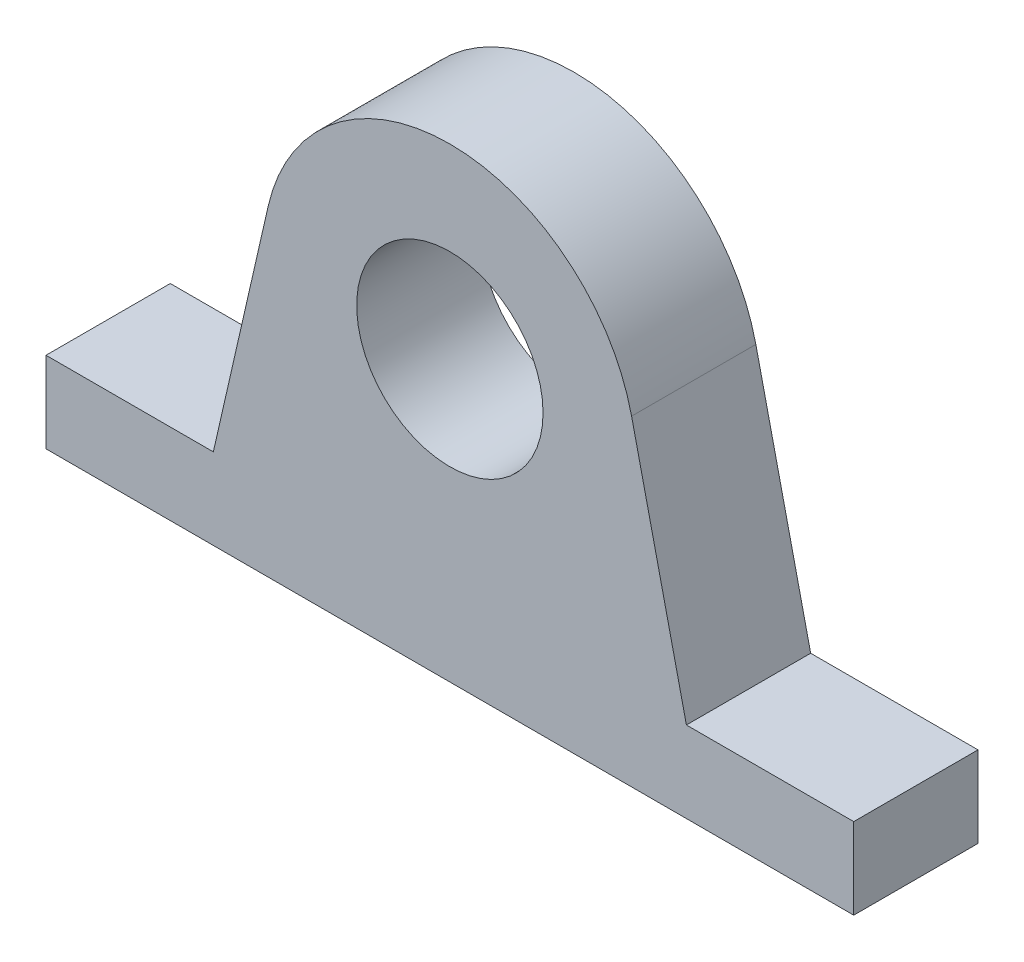
ISO-10303-21;
HEADER;
FILE_DESCRIPTION(('STEP AP214'),'2;1');
FILE_NAME('part.step','',(''),(''),'','','');
FILE_SCHEMA(('AUTOMOTIVE_DESIGN { 1 0 10303 214 1 1 1 1 }'));
ENDSEC;
DATA;
#1=APPLICATION_CONTEXT('core data for automotive mechanical design processes');
#2=APPLICATION_PROTOCOL_DEFINITION('international standard','automotive_design',2000,#1);
#3=PRODUCT_CONTEXT('',#1,'mechanical');
#4=PRODUCT('Part','Part','',(#3));
#5=PRODUCT_RELATED_PRODUCT_CATEGORY('part','',(#4));
#6=PRODUCT_DEFINITION_FORMATION('','',#4);
#7=PRODUCT_DEFINITION_CONTEXT('part definition',#1,'design');
#8=PRODUCT_DEFINITION('design','',#6,#7);
#9=PRODUCT_DEFINITION_SHAPE('','',#8);
#10=(LENGTH_UNIT() NAMED_UNIT(*) SI_UNIT(.MILLI.,.METRE.));
#11=(NAMED_UNIT(*) PLANE_ANGLE_UNIT() SI_UNIT($,.RADIAN.));
#12=(NAMED_UNIT(*) SI_UNIT($,.STERADIAN.) SOLID_ANGLE_UNIT());
#13=UNCERTAINTY_MEASURE_WITH_UNIT(LENGTH_MEASURE(1.E-05),#10,'distance_accuracy_value','');
#14=(GEOMETRIC_REPRESENTATION_CONTEXT(3) GLOBAL_UNCERTAINTY_ASSIGNED_CONTEXT((#13)) GLOBAL_UNIT_ASSIGNED_CONTEXT((#10,
#11,#12)) REPRESENTATION_CONTEXT('',''));
#15=CARTESIAN_POINT('',(0.,0.,0.));
#16=DIRECTION('',(0.,0.,1.));
#17=DIRECTION('',(1.,0.,0.));
#18=AXIS2_PLACEMENT_3D('',#15,#16,#17);
#19=CARTESIAN_POINT('',(0.,9.,4.));
#20=DIRECTION('',(0.,0.,1.));
#21=DIRECTION('',(1.,0.,0.));
#22=AXIS2_PLACEMENT_3D('',#19,#20,#21);
#23=PLANE('',#22);
#24=DIRECTION('',(-1.,0.,0.));
#25=VECTOR('',#24,1.);
#26=CARTESIAN_POINT('',(-13.,2.60921355768114,4.));
#27=LINE('',#26,#25);
#28=CARTESIAN_POINT('',(-7.61378638619367,2.60921355768114,4.));
#29=VERTEX_POINT('',#28);
#30=CARTESIAN_POINT('',(-13.,2.60921355768114,4.));
#31=VERTEX_POINT('',#30);
#32=EDGE_CURVE('E146',#29,#31,#27,.T.);
#33=ORIENTED_EDGE('',*,*,#32,.T.);
#34=DIRECTION('',(0.,-1.,0.));
#35=VECTOR('',#34,1.);
#36=CARTESIAN_POINT('',(-13.,0.,4.));
#37=LINE('',#36,#35);
#38=CARTESIAN_POINT('',(-13.,0.,4.));
#39=VERTEX_POINT('',#38);
#40=EDGE_CURVE('E93',#31,#39,#37,.T.);
#41=ORIENTED_EDGE('',*,*,#40,.T.);
#42=DIRECTION('',(1.,0.,0.));
#43=VECTOR('',#42,1.);
#44=CARTESIAN_POINT('',(-8.2096026206597,0.,4.));
#45=LINE('',#44,#43);
#46=CARTESIAN_POINT('',(13.,0.,4.));
#47=VERTEX_POINT('',#46);
#48=EDGE_CURVE('E160',#39,#47,#45,.T.);
#49=ORIENTED_EDGE('',*,*,#48,.T.);
#50=DIRECTION('',(0.,1.,0.));
#51=VECTOR('',#50,1.);
#52=CARTESIAN_POINT('',(13.,0.,4.));
#53=LINE('',#52,#51);
#54=CARTESIAN_POINT('',(13.,2.60921355768114,4.));
#55=VERTEX_POINT('',#54);
#56=EDGE_CURVE('E175',#47,#55,#53,.T.);
#57=ORIENTED_EDGE('',*,*,#56,.T.);
#58=DIRECTION('',(-1.,0.,0.));
#59=VECTOR('',#58,1.);
#60=CARTESIAN_POINT('',(13.,2.60921355768114,4.));
#61=LINE('',#60,#59);
#62=CARTESIAN_POINT('',(7.61378638619367,2.60921355768114,4.));
#63=VERTEX_POINT('',#62);
#64=EDGE_CURVE('E112',#55,#63,#61,.T.);
#65=ORIENTED_EDGE('',*,*,#64,.T.);
#66=DIRECTION('',(-0.222620466270927,0.974905189234992,0.));
#67=VECTOR('',#66,1.);
#68=CARTESIAN_POINT('',(7.61378638619367,2.60921355768114,4.));
#69=LINE('',#68,#67);
#70=CARTESIAN_POINT('',(5.84943113540995,10.3357227976256,4.));
#71=VERTEX_POINT('',#70);
#72=EDGE_CURVE('E106',#63,#71,#69,.T.);
#73=ORIENTED_EDGE('',*,*,#72,.T.);
#74=CARTESIAN_POINT('',(0.,9.,4.));
#75=DIRECTION('',(0.,0.,1.));
#76=DIRECTION('',(1.,0.,0.));
#77=AXIS2_PLACEMENT_3D('',#74,#75,#76);
#78=CIRCLE('',#77,6.);
#79=CARTESIAN_POINT('',(-5.84943113540995,10.3357227976256,4.));
#80=VERTEX_POINT('',#79);
#81=EDGE_CURVE('E110',#71,#80,#78,.T.);
#82=ORIENTED_EDGE('',*,*,#81,.T.);
#83=DIRECTION('',(-0.222620466270927,-0.974905189234992,0.));
#84=VECTOR('',#83,1.);
#85=CARTESIAN_POINT('',(-7.61378638619367,2.60921355768114,4.));
#86=LINE('',#85,#84);
#87=EDGE_CURVE('E50',#80,#29,#86,.T.);
#88=ORIENTED_EDGE('',*,*,#87,.T.);
#89=EDGE_LOOP('',(#33,#41,#49,#57,#65,#73,#82,#88));
#90=FACE_BOUND('',#89,.T.);
#91=CARTESIAN_POINT('',(0.,9.,4.));
#92=DIRECTION('',(0.,0.,1.));
#93=DIRECTION('',(1.,0.,0.));
#94=AXIS2_PLACEMENT_3D('',#91,#92,#93);
#95=CIRCLE('',#94,3.);
#96=CARTESIAN_POINT('',(3.,9.,4.));
#97=VERTEX_POINT('',#96);
#98=EDGE_CURVE('E134',#97,#97,#95,.T.);
#99=ORIENTED_EDGE('',*,*,#98,.F.);
#100=EDGE_LOOP('',(#99));
#101=FACE_BOUND('',#100,.T.);
#102=ADVANCED_FACE('F33',(#90,#101),#23,.T.);
#103=CARTESIAN_POINT('',(0.,9.,0.));
#104=DIRECTION('',(0.,0.,1.));
#105=DIRECTION('',(1.,0.,0.));
#106=AXIS2_PLACEMENT_3D('',#103,#104,#105);
#107=PLANE('',#106);
#108=DIRECTION('',(-1.,0.,0.));
#109=VECTOR('',#108,1.);
#110=CARTESIAN_POINT('',(-13.,2.60921355768114,0.));
#111=LINE('',#110,#109);
#112=CARTESIAN_POINT('',(-7.61378638619367,2.60921355768114,0.));
#113=VERTEX_POINT('',#112);
#114=CARTESIAN_POINT('',(-13.,2.60921355768114,0.));
#115=VERTEX_POINT('',#114);
#116=EDGE_CURVE('E130',#113,#115,#111,.T.);
#117=ORIENTED_EDGE('',*,*,#116,.F.);
#118=DIRECTION('',(-0.222620466270927,-0.974905189234992,0.));
#119=VECTOR('',#118,1.);
#120=CARTESIAN_POINT('',(-7.61378638619367,2.60921355768114,0.));
#121=LINE('',#120,#119);
#122=CARTESIAN_POINT('',(-5.84943113540995,10.3357227976256,0.));
#123=VERTEX_POINT('',#122);
#124=EDGE_CURVE('E85',#123,#113,#121,.T.);
#125=ORIENTED_EDGE('',*,*,#124,.F.);
#126=CARTESIAN_POINT('',(0.,9.,0.));
#127=DIRECTION('',(0.,0.,1.));
#128=DIRECTION('',(1.,0.,0.));
#129=AXIS2_PLACEMENT_3D('',#126,#127,#128);
#130=CIRCLE('',#129,6.);
#131=CARTESIAN_POINT('',(5.84943113540995,10.3357227976256,0.));
#132=VERTEX_POINT('',#131);
#133=EDGE_CURVE('E79',#132,#123,#130,.T.);
#134=ORIENTED_EDGE('',*,*,#133,.F.);
#135=DIRECTION('',(-0.222620466270927,0.974905189234992,0.));
#136=VECTOR('',#135,1.);
#137=CARTESIAN_POINT('',(7.61378638619367,2.60921355768114,0.));
#138=LINE('',#137,#136);
#139=CARTESIAN_POINT('',(7.61378638619367,2.60921355768114,0.));
#140=VERTEX_POINT('',#139);
#141=EDGE_CURVE('E120',#140,#132,#138,.T.);
#142=ORIENTED_EDGE('',*,*,#141,.F.);
#143=DIRECTION('',(-1.,0.,0.));
#144=VECTOR('',#143,1.);
#145=CARTESIAN_POINT('',(13.,2.60921355768114,0.));
#146=LINE('',#145,#144);
#147=CARTESIAN_POINT('',(13.,2.60921355768114,0.));
#148=VERTEX_POINT('',#147);
#149=EDGE_CURVE('E141',#148,#140,#146,.T.);
#150=ORIENTED_EDGE('',*,*,#149,.F.);
#151=DIRECTION('',(0.,1.,0.));
#152=VECTOR('',#151,1.);
#153=CARTESIAN_POINT('',(13.,0.,0.));
#154=LINE('',#153,#152);
#155=CARTESIAN_POINT('',(13.,0.,0.));
#156=VERTEX_POINT('',#155);
#157=EDGE_CURVE('E139',#156,#148,#154,.T.);
#158=ORIENTED_EDGE('',*,*,#157,.F.);
#159=DIRECTION('',(1.,0.,0.));
#160=VECTOR('',#159,1.);
#161=CARTESIAN_POINT('',(8.2096026206597,0.,0.));
#162=LINE('',#161,#160);
#163=CARTESIAN_POINT('',(-13.,0.,0.));
#164=VERTEX_POINT('',#163);
#165=EDGE_CURVE('E137',#164,#156,#162,.T.);
#166=ORIENTED_EDGE('',*,*,#165,.F.);
#167=DIRECTION('',(0.,-1.,0.));
#168=VECTOR('',#167,1.);
#169=CARTESIAN_POINT('',(-13.,0.,0.));
#170=LINE('',#169,#168);
#171=EDGE_CURVE('E133',#115,#164,#170,.T.);
#172=ORIENTED_EDGE('',*,*,#171,.F.);
#173=EDGE_LOOP('',(#117,#125,#134,#142,#150,#158,#166,#172));
#174=FACE_BOUND('',#173,.T.);
#175=CARTESIAN_POINT('',(0.,9.,0.));
#176=DIRECTION('',(0.,0.,1.));
#177=DIRECTION('',(1.,0.,0.));
#178=AXIS2_PLACEMENT_3D('',#175,#176,#177);
#179=CIRCLE('',#178,3.);
#180=CARTESIAN_POINT('',(3.,9.,0.));
#181=VERTEX_POINT('',#180);
#182=EDGE_CURVE('E181',#181,#181,#179,.T.);
#183=ORIENTED_EDGE('',*,*,#182,.T.);
#184=EDGE_LOOP('',(#183));
#185=FACE_BOUND('',#184,.T.);
#186=ADVANCED_FACE('F165',(#174,#185),#107,.F.);
#187=CARTESIAN_POINT('',(-13.,2.60921355768114,4.));
#188=DIRECTION('',(0.,-1.,0.));
#189=DIRECTION('',(0.,0.,-1.));
#190=AXIS2_PLACEMENT_3D('',#187,#188,#189);
#191=PLANE('',#190);
#192=ORIENTED_EDGE('',*,*,#116,.T.);
#193=DIRECTION('',(0.,0.,-1.));
#194=VECTOR('',#193,1.);
#195=CARTESIAN_POINT('',(-13.,2.60921355768114,4.));
#196=LINE('',#195,#194);
#197=EDGE_CURVE('E11',#31,#115,#196,.T.);
#198=ORIENTED_EDGE('',*,*,#197,.F.);
#199=ORIENTED_EDGE('',*,*,#32,.F.);
#200=DIRECTION('',(0.,0.,-1.));
#201=VECTOR('',#200,1.);
#202=CARTESIAN_POINT('',(-7.61378638619367,2.60921355768114,4.));
#203=LINE('',#202,#201);
#204=EDGE_CURVE('E126',#29,#113,#203,.T.);
#205=ORIENTED_EDGE('',*,*,#204,.T.);
#206=EDGE_LOOP('',(#192,#198,#199,#205));
#207=FACE_BOUND('',#206,.T.);
#208=ADVANCED_FACE('F35',(#207),#191,.F.);
#209=CARTESIAN_POINT('',(-13.,0.,4.));
#210=DIRECTION('',(1.,0.,0.));
#211=DIRECTION('',(0.,0.,-1.));
#212=AXIS2_PLACEMENT_3D('',#209,#210,#211);
#213=PLANE('',#212);
#214=ORIENTED_EDGE('',*,*,#171,.T.);
#215=DIRECTION('',(0.,0.,-1.));
#216=VECTOR('',#215,1.);
#217=CARTESIAN_POINT('',(-13.,0.,4.));
#218=LINE('',#217,#216);
#219=EDGE_CURVE('E42',#39,#164,#218,.T.);
#220=ORIENTED_EDGE('',*,*,#219,.F.);
#221=ORIENTED_EDGE('',*,*,#40,.F.);
#222=ORIENTED_EDGE('',*,*,#197,.T.);
#223=EDGE_LOOP('',(#214,#220,#221,#222));
#224=FACE_BOUND('',#223,.T.);
#225=ADVANCED_FACE('F161',(#224),#213,.F.);
#226=CARTESIAN_POINT('',(8.2096026206597,0.,4.));
#227=DIRECTION('',(0.,1.,0.));
#228=DIRECTION('',(-1.,0.,0.));
#229=AXIS2_PLACEMENT_3D('',#226,#227,#228);
#230=PLANE('',#229);
#231=ORIENTED_EDGE('',*,*,#165,.T.);
#232=DIRECTION('',(0.,0.,-1.));
#233=VECTOR('',#232,1.);
#234=CARTESIAN_POINT('',(13.,0.,4.));
#235=LINE('',#234,#233);
#236=EDGE_CURVE('E153',#47,#156,#235,.T.);
#237=ORIENTED_EDGE('',*,*,#236,.F.);
#238=ORIENTED_EDGE('',*,*,#48,.F.);
#239=ORIENTED_EDGE('',*,*,#219,.T.);
#240=EDGE_LOOP('',(#231,#237,#238,#239));
#241=FACE_BOUND('',#240,.T.);
#242=ADVANCED_FACE('F158',(#241),#230,.F.);
#243=CARTESIAN_POINT('',(13.,0.,4.));
#244=DIRECTION('',(-1.,0.,0.));
#245=DIRECTION('',(0.,0.,1.));
#246=AXIS2_PLACEMENT_3D('',#243,#244,#245);
#247=PLANE('',#246);
#248=ORIENTED_EDGE('',*,*,#157,.T.);
#249=DIRECTION('',(0.,0.,-1.));
#250=VECTOR('',#249,1.);
#251=CARTESIAN_POINT('',(13.,2.60921355768114,4.));
#252=LINE('',#251,#250);
#253=EDGE_CURVE('E150',#55,#148,#252,.T.);
#254=ORIENTED_EDGE('',*,*,#253,.F.);
#255=ORIENTED_EDGE('',*,*,#56,.F.);
#256=ORIENTED_EDGE('',*,*,#236,.T.);
#257=EDGE_LOOP('',(#248,#254,#255,#256));
#258=FACE_BOUND('',#257,.T.);
#259=ADVANCED_FACE('F171',(#258),#247,.F.);
#260=CARTESIAN_POINT('',(13.,2.60921355768114,4.));
#261=DIRECTION('',(0.,-1.,0.));
#262=DIRECTION('',(0.,0.,-1.));
#263=AXIS2_PLACEMENT_3D('',#260,#261,#262);
#264=PLANE('',#263);
#265=ORIENTED_EDGE('',*,*,#149,.T.);
#266=DIRECTION('',(0.,0.,-1.));
#267=VECTOR('',#266,1.);
#268=CARTESIAN_POINT('',(7.61378638619367,2.60921355768114,4.));
#269=LINE('',#268,#267);
#270=EDGE_CURVE('E121',#63,#140,#269,.T.);
#271=ORIENTED_EDGE('',*,*,#270,.F.);
#272=ORIENTED_EDGE('',*,*,#64,.F.);
#273=ORIENTED_EDGE('',*,*,#253,.T.);
#274=EDGE_LOOP('',(#265,#271,#272,#273));
#275=FACE_BOUND('',#274,.T.);
#276=ADVANCED_FACE('F174',(#275),#264,.F.);
#277=CARTESIAN_POINT('',(7.61378638619367,2.60921355768114,4.));
#278=DIRECTION('',(-0.974905189234992,-0.222620466270927,0.));
#279=DIRECTION('',(0.222620466270927,-0.974905189234992,0.));
#280=AXIS2_PLACEMENT_3D('',#277,#278,#279);
#281=PLANE('',#280);
#282=ORIENTED_EDGE('',*,*,#141,.T.);
#283=DIRECTION('',(0.,0.,-1.));
#284=VECTOR('',#283,1.);
#285=CARTESIAN_POINT('',(5.84943113540995,10.3357227976256,4.));
#286=LINE('',#285,#284);
#287=EDGE_CURVE('E117',#71,#132,#286,.T.);
#288=ORIENTED_EDGE('',*,*,#287,.F.);
#289=ORIENTED_EDGE('',*,*,#72,.F.);
#290=ORIENTED_EDGE('',*,*,#270,.T.);
#291=EDGE_LOOP('',(#282,#288,#289,#290));
#292=FACE_BOUND('',#291,.T.);
#293=ADVANCED_FACE('F118',(#292),#281,.F.);
#294=CARTESIAN_POINT('',(0.,9.,4.));
#295=DIRECTION('',(0.,0.,-1.));
#296=DIRECTION('',(-1.,0.,0.));
#297=AXIS2_PLACEMENT_3D('',#294,#295,#296);
#298=CYLINDRICAL_SURFACE('',#297,6.);
#299=ORIENTED_EDGE('',*,*,#133,.T.);
#300=DIRECTION('',(0.,0.,-1.));
#301=VECTOR('',#300,1.);
#302=CARTESIAN_POINT('',(-5.84943113540995,10.3357227976256,4.));
#303=LINE('',#302,#301);
#304=EDGE_CURVE('E122',#80,#123,#303,.T.);
#305=ORIENTED_EDGE('',*,*,#304,.F.);
#306=ORIENTED_EDGE('',*,*,#81,.F.);
#307=ORIENTED_EDGE('',*,*,#287,.T.);
#308=EDGE_LOOP('',(#299,#305,#306,#307));
#309=FACE_BOUND('',#308,.T.);
#310=ADVANCED_FACE('F124',(#309),#298,.T.);
#311=CARTESIAN_POINT('',(-7.61378638619367,2.60921355768114,4.));
#312=DIRECTION('',(0.974905189234992,-0.222620466270927,0.));
#313=DIRECTION('',(0.222620466270927,0.974905189234992,0.));
#314=AXIS2_PLACEMENT_3D('',#311,#312,#313);
#315=PLANE('',#314);
#316=ORIENTED_EDGE('',*,*,#124,.T.);
#317=ORIENTED_EDGE('',*,*,#204,.F.);
#318=ORIENTED_EDGE('',*,*,#87,.F.);
#319=ORIENTED_EDGE('',*,*,#304,.T.);
#320=EDGE_LOOP('',(#316,#317,#318,#319));
#321=FACE_BOUND('',#320,.T.);
#322=ADVANCED_FACE('F197',(#321),#315,.F.);
#323=CARTESIAN_POINT('',(0.,9.,4.));
#324=DIRECTION('',(0.,0.,-1.));
#325=DIRECTION('',(-1.,0.,0.));
#326=AXIS2_PLACEMENT_3D('',#323,#324,#325);
#327=CYLINDRICAL_SURFACE('',#326,3.);
#328=ORIENTED_EDGE('',*,*,#98,.T.);
#329=EDGE_LOOP('',(#328));
#330=FACE_BOUND('',#329,.T.);
#331=ORIENTED_EDGE('',*,*,#182,.F.);
#332=EDGE_LOOP('',(#331));
#333=FACE_BOUND('',#332,.T.);
#334=ADVANCED_FACE('F187',(#330,#333),#327,.F.);
#335=CLOSED_SHELL('',(#102,#186,#208,#225,#242,#259,#276,#293,#310,#322,#334));
#336=MANIFOLD_SOLID_BREP('B2',#335);
#337=ADVANCED_BREP_SHAPE_REPRESENTATION('',(#18,#336),#14);
#338=SHAPE_DEFINITION_REPRESENTATION(#9,#337);
ENDSEC;
END-ISO-10303-21;
